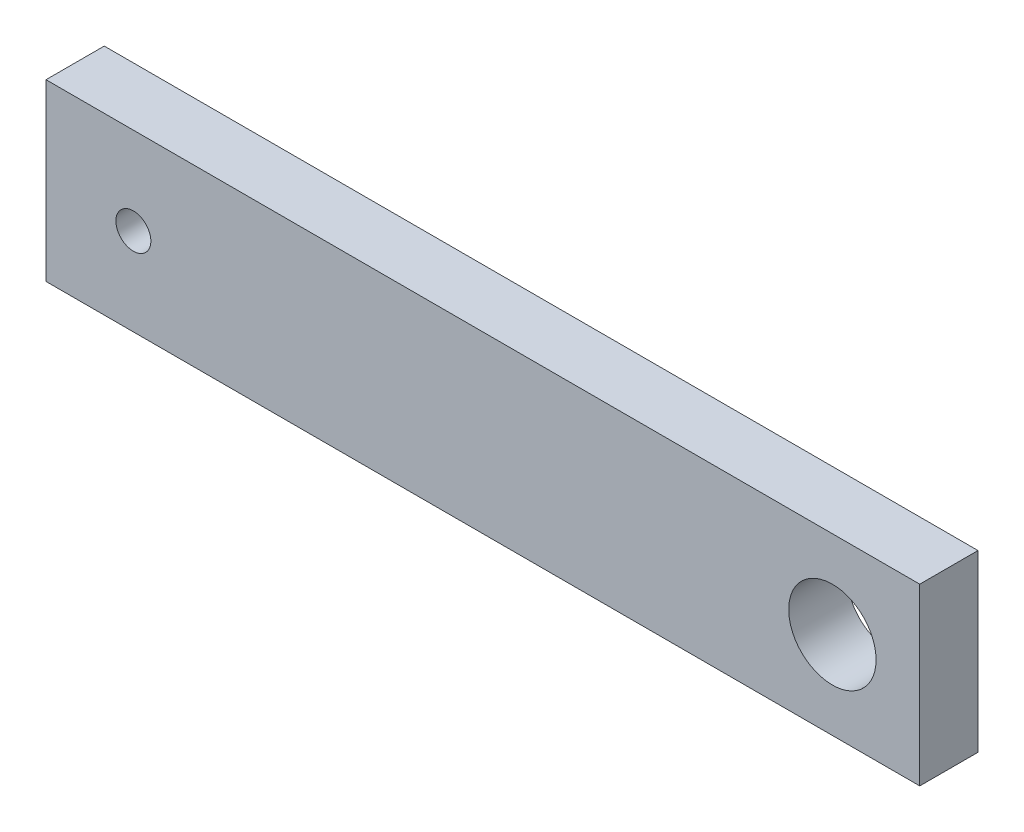
ISO-10303-21;
HEADER;
FILE_DESCRIPTION(('STEP AP214'),'2;1');
FILE_NAME('part.step','',(''),(''),'','','');
FILE_SCHEMA(('AUTOMOTIVE_DESIGN { 1 0 10303 214 1 1 1 1 }'));
ENDSEC;
DATA;
#1=APPLICATION_CONTEXT('core data for automotive mechanical design processes');
#2=APPLICATION_PROTOCOL_DEFINITION('international standard','automotive_design',2000,#1);
#3=PRODUCT_CONTEXT('',#1,'mechanical');
#4=PRODUCT('Part','Part','',(#3));
#5=PRODUCT_RELATED_PRODUCT_CATEGORY('part','',(#4));
#6=PRODUCT_DEFINITION_FORMATION('','',#4);
#7=PRODUCT_DEFINITION_CONTEXT('part definition',#1,'design');
#8=PRODUCT_DEFINITION('design','',#6,#7);
#9=PRODUCT_DEFINITION_SHAPE('','',#8);
#10=(LENGTH_UNIT() NAMED_UNIT(*) SI_UNIT(.MILLI.,.METRE.));
#11=(NAMED_UNIT(*) PLANE_ANGLE_UNIT() SI_UNIT($,.RADIAN.));
#12=(NAMED_UNIT(*) SI_UNIT($,.STERADIAN.) SOLID_ANGLE_UNIT());
#13=UNCERTAINTY_MEASURE_WITH_UNIT(LENGTH_MEASURE(1.E-05),#10,'distance_accuracy_value','');
#14=(GEOMETRIC_REPRESENTATION_CONTEXT(3) GLOBAL_UNCERTAINTY_ASSIGNED_CONTEXT((#13)) GLOBAL_UNIT_ASSIGNED_CONTEXT((#10,
#11,#12)) REPRESENTATION_CONTEXT('',''));
#15=CARTESIAN_POINT('',(0.,0.,0.));
#16=DIRECTION('',(0.,0.,1.));
#17=DIRECTION('',(1.,0.,0.));
#18=AXIS2_PLACEMENT_3D('',#15,#16,#17);
#19=CARTESIAN_POINT('',(0.,0.,2.));
#20=DIRECTION('',(0.,0.,1.));
#21=DIRECTION('',(1.,0.,0.));
#22=AXIS2_PLACEMENT_3D('',#19,#20,#21);
#23=PLANE('',#22);
#24=CARTESIAN_POINT('',(-27.,3.,2.));
#25=DIRECTION('',(0.,0.,1.));
#26=DIRECTION('',(1.,0.,0.));
#27=AXIS2_PLACEMENT_3D('',#24,#25,#26);
#28=CIRCLE('',#27,0.6);
#29=CARTESIAN_POINT('',(-26.4,3.,2.));
#30=VERTEX_POINT('',#29);
#31=EDGE_CURVE('E112',#30,#30,#28,.T.);
#32=ORIENTED_EDGE('',*,*,#31,.F.);
#33=EDGE_LOOP('',(#32));
#34=FACE_BOUND('',#33,.T.);
#35=DIRECTION('',(0.,1.,0.));
#36=VECTOR('',#35,1.);
#37=CARTESIAN_POINT('',(0.,0.,2.));
#38=LINE('',#37,#36);
#39=CARTESIAN_POINT('',(0.,0.,2.));
#40=VERTEX_POINT('',#39);
#41=CARTESIAN_POINT('',(0.,6.,2.));
#42=VERTEX_POINT('',#41);
#43=EDGE_CURVE('E92',#40,#42,#38,.T.);
#44=ORIENTED_EDGE('',*,*,#43,.T.);
#45=DIRECTION('',(-1.,0.,0.));
#46=VECTOR('',#45,1.);
#47=CARTESIAN_POINT('',(0.,6.,2.));
#48=LINE('',#47,#46);
#49=CARTESIAN_POINT('',(-30.,5.99999999999999,2.));
#50=VERTEX_POINT('',#49);
#51=EDGE_CURVE('E87',#42,#50,#48,.T.);
#52=ORIENTED_EDGE('',*,*,#51,.T.);
#53=DIRECTION('',(0.,-1.,0.));
#54=VECTOR('',#53,1.);
#55=CARTESIAN_POINT('',(-30.,0.,2.));
#56=LINE('',#55,#54);
#57=CARTESIAN_POINT('',(-30.,0.,2.));
#58=VERTEX_POINT('',#57);
#59=EDGE_CURVE('E90',#50,#58,#56,.T.);
#60=ORIENTED_EDGE('',*,*,#59,.T.);
#61=DIRECTION('',(1.,0.,0.));
#62=VECTOR('',#61,1.);
#63=CARTESIAN_POINT('',(0.,0.,2.));
#64=LINE('',#63,#62);
#65=EDGE_CURVE('E57',#58,#40,#64,.T.);
#66=ORIENTED_EDGE('',*,*,#65,.T.);
#67=EDGE_LOOP('',(#44,#52,#60,#66));
#68=FACE_BOUND('',#67,.T.);
#69=CARTESIAN_POINT('',(-3.,3.,2.));
#70=DIRECTION('',(0.,0.,1.));
#71=DIRECTION('',(1.,0.,0.));
#72=AXIS2_PLACEMENT_3D('',#69,#70,#71);
#73=CIRCLE('',#72,1.5);
#74=CARTESIAN_POINT('',(-1.5,3.,2.));
#75=VERTEX_POINT('',#74);
#76=EDGE_CURVE('E134',#75,#75,#73,.T.);
#77=ORIENTED_EDGE('',*,*,#76,.F.);
#78=EDGE_LOOP('',(#77));
#79=FACE_BOUND('',#78,.T.);
#80=ADVANCED_FACE('F39',(#34,#68,#79),#23,.T.);
#81=CARTESIAN_POINT('',(0.,0.,0.));
#82=DIRECTION('',(0.,0.,1.));
#83=DIRECTION('',(1.,0.,0.));
#84=AXIS2_PLACEMENT_3D('',#81,#82,#83);
#85=PLANE('',#84);
#86=DIRECTION('',(0.,1.,0.));
#87=VECTOR('',#86,1.);
#88=CARTESIAN_POINT('',(0.,0.,0.));
#89=LINE('',#88,#87);
#90=CARTESIAN_POINT('',(0.,0.,0.));
#91=VERTEX_POINT('',#90);
#92=CARTESIAN_POINT('',(0.,6.,0.));
#93=VERTEX_POINT('',#92);
#94=EDGE_CURVE('E108',#91,#93,#89,.T.);
#95=ORIENTED_EDGE('',*,*,#94,.F.);
#96=DIRECTION('',(1.,0.,0.));
#97=VECTOR('',#96,1.);
#98=CARTESIAN_POINT('',(0.,0.,0.));
#99=LINE('',#98,#97);
#100=CARTESIAN_POINT('',(-30.,0.,0.));
#101=VERTEX_POINT('',#100);
#102=EDGE_CURVE('E80',#101,#91,#99,.T.);
#103=ORIENTED_EDGE('',*,*,#102,.F.);
#104=DIRECTION('',(0.,-1.,0.));
#105=VECTOR('',#104,1.);
#106=CARTESIAN_POINT('',(-30.,0.,0.));
#107=LINE('',#106,#105);
#108=CARTESIAN_POINT('',(-30.,5.99999999999999,0.));
#109=VERTEX_POINT('',#108);
#110=EDGE_CURVE('E74',#109,#101,#107,.T.);
#111=ORIENTED_EDGE('',*,*,#110,.F.);
#112=DIRECTION('',(-1.,0.,0.));
#113=VECTOR('',#112,1.);
#114=CARTESIAN_POINT('',(0.,6.,0.));
#115=LINE('',#114,#113);
#116=EDGE_CURVE('E97',#93,#109,#115,.T.);
#117=ORIENTED_EDGE('',*,*,#116,.F.);
#118=EDGE_LOOP('',(#95,#103,#111,#117));
#119=FACE_BOUND('',#118,.T.);
#120=CARTESIAN_POINT('',(-27.,3.,0.));
#121=DIRECTION('',(0.,0.,1.));
#122=DIRECTION('',(1.,0.,0.));
#123=AXIS2_PLACEMENT_3D('',#120,#121,#122);
#124=CIRCLE('',#123,0.6);
#125=CARTESIAN_POINT('',(-26.4,3.,0.));
#126=VERTEX_POINT('',#125);
#127=EDGE_CURVE('E130',#126,#126,#124,.T.);
#128=ORIENTED_EDGE('',*,*,#127,.T.);
#129=EDGE_LOOP('',(#128));
#130=FACE_BOUND('',#129,.T.);
#131=CARTESIAN_POINT('',(-3.,3.,0.));
#132=DIRECTION('',(0.,0.,1.));
#133=DIRECTION('',(1.,0.,0.));
#134=AXIS2_PLACEMENT_3D('',#131,#132,#133);
#135=CIRCLE('',#134,1.5);
#136=CARTESIAN_POINT('',(-1.5,3.,0.));
#137=VERTEX_POINT('',#136);
#138=EDGE_CURVE('E138',#137,#137,#135,.T.);
#139=ORIENTED_EDGE('',*,*,#138,.T.);
#140=EDGE_LOOP('',(#139));
#141=FACE_BOUND('',#140,.T.);
#142=ADVANCED_FACE('F125',(#119,#130,#141),#85,.F.);
#143=CARTESIAN_POINT('',(0.,0.,2.));
#144=DIRECTION('',(-1.,0.,0.));
#145=DIRECTION('',(0.,-1.,0.));
#146=AXIS2_PLACEMENT_3D('',#143,#144,#145);
#147=PLANE('',#146);
#148=ORIENTED_EDGE('',*,*,#94,.T.);
#149=DIRECTION('',(0.,0.,-1.));
#150=VECTOR('',#149,1.);
#151=CARTESIAN_POINT('',(0.,6.,2.));
#152=LINE('',#151,#150);
#153=EDGE_CURVE('E11',#42,#93,#152,.T.);
#154=ORIENTED_EDGE('',*,*,#153,.F.);
#155=ORIENTED_EDGE('',*,*,#43,.F.);
#156=DIRECTION('',(0.,0.,-1.));
#157=VECTOR('',#156,1.);
#158=CARTESIAN_POINT('',(0.,0.,2.));
#159=LINE('',#158,#157);
#160=EDGE_CURVE('E104',#40,#91,#159,.T.);
#161=ORIENTED_EDGE('',*,*,#160,.T.);
#162=EDGE_LOOP('',(#148,#154,#155,#161));
#163=FACE_BOUND('',#162,.T.);
#164=ADVANCED_FACE('F41',(#163),#147,.F.);
#165=CARTESIAN_POINT('',(0.,6.,2.));
#166=DIRECTION('',(0.,-1.,0.));
#167=DIRECTION('',(1.,0.,0.));
#168=AXIS2_PLACEMENT_3D('',#165,#166,#167);
#169=PLANE('',#168);
#170=ORIENTED_EDGE('',*,*,#116,.T.);
#171=DIRECTION('',(0.,0.,-1.));
#172=VECTOR('',#171,1.);
#173=CARTESIAN_POINT('',(-30.,5.99999999999999,2.));
#174=LINE('',#173,#172);
#175=EDGE_CURVE('E49',#50,#109,#174,.T.);
#176=ORIENTED_EDGE('',*,*,#175,.F.);
#177=ORIENTED_EDGE('',*,*,#51,.F.);
#178=ORIENTED_EDGE('',*,*,#153,.T.);
#179=EDGE_LOOP('',(#170,#176,#177,#178));
#180=FACE_BOUND('',#179,.T.);
#181=ADVANCED_FACE('F96',(#180),#169,.F.);
#182=CARTESIAN_POINT('',(-30.,0.,2.));
#183=DIRECTION('',(1.,0.,0.));
#184=DIRECTION('',(0.,0.,-1.));
#185=AXIS2_PLACEMENT_3D('',#182,#183,#184);
#186=PLANE('',#185);
#187=ORIENTED_EDGE('',*,*,#110,.T.);
#188=DIRECTION('',(0.,0.,-1.));
#189=VECTOR('',#188,1.);
#190=CARTESIAN_POINT('',(-30.,0.,2.));
#191=LINE('',#190,#189);
#192=EDGE_CURVE('E99',#58,#101,#191,.T.);
#193=ORIENTED_EDGE('',*,*,#192,.F.);
#194=ORIENTED_EDGE('',*,*,#59,.F.);
#195=ORIENTED_EDGE('',*,*,#175,.T.);
#196=EDGE_LOOP('',(#187,#193,#194,#195));
#197=FACE_BOUND('',#196,.T.);
#198=ADVANCED_FACE('F100',(#197),#186,.F.);
#199=CARTESIAN_POINT('',(0.,0.,2.));
#200=DIRECTION('',(0.,1.,0.));
#201=DIRECTION('',(-1.,0.,0.));
#202=AXIS2_PLACEMENT_3D('',#199,#200,#201);
#203=PLANE('',#202);
#204=ORIENTED_EDGE('',*,*,#102,.T.);
#205=ORIENTED_EDGE('',*,*,#160,.F.);
#206=ORIENTED_EDGE('',*,*,#65,.F.);
#207=ORIENTED_EDGE('',*,*,#192,.T.);
#208=EDGE_LOOP('',(#204,#205,#206,#207));
#209=FACE_BOUND('',#208,.T.);
#210=ADVANCED_FACE('F122',(#209),#203,.F.);
#211=CARTESIAN_POINT('',(-27.,3.,2.));
#212=DIRECTION('',(0.,0.,-1.));
#213=DIRECTION('',(-1.,0.,0.));
#214=AXIS2_PLACEMENT_3D('',#211,#212,#213);
#215=CYLINDRICAL_SURFACE('',#214,0.6);
#216=ORIENTED_EDGE('',*,*,#31,.T.);
#217=EDGE_LOOP('',(#216));
#218=FACE_BOUND('',#217,.T.);
#219=ORIENTED_EDGE('',*,*,#127,.F.);
#220=EDGE_LOOP('',(#219));
#221=FACE_BOUND('',#220,.T.);
#222=ADVANCED_FACE('F157',(#218,#221),#215,.F.);
#223=CARTESIAN_POINT('',(-3.,3.,2.));
#224=DIRECTION('',(0.,0.,-1.));
#225=DIRECTION('',(-1.,0.,0.));
#226=AXIS2_PLACEMENT_3D('',#223,#224,#225);
#227=CYLINDRICAL_SURFACE('',#226,1.5);
#228=ORIENTED_EDGE('',*,*,#76,.T.);
#229=EDGE_LOOP('',(#228));
#230=FACE_BOUND('',#229,.T.);
#231=ORIENTED_EDGE('',*,*,#138,.F.);
#232=EDGE_LOOP('',(#231));
#233=FACE_BOUND('',#232,.T.);
#234=ADVANCED_FACE('F146',(#230,#233),#227,.F.);
#235=CLOSED_SHELL('',(#80,#142,#164,#181,#198,#210,#222,#234));
#236=MANIFOLD_SOLID_BREP('B2',#235);
#237=ADVANCED_BREP_SHAPE_REPRESENTATION('',(#18,#236),#14);
#238=SHAPE_DEFINITION_REPRESENTATION(#9,#237);
ENDSEC;
END-ISO-10303-21;
